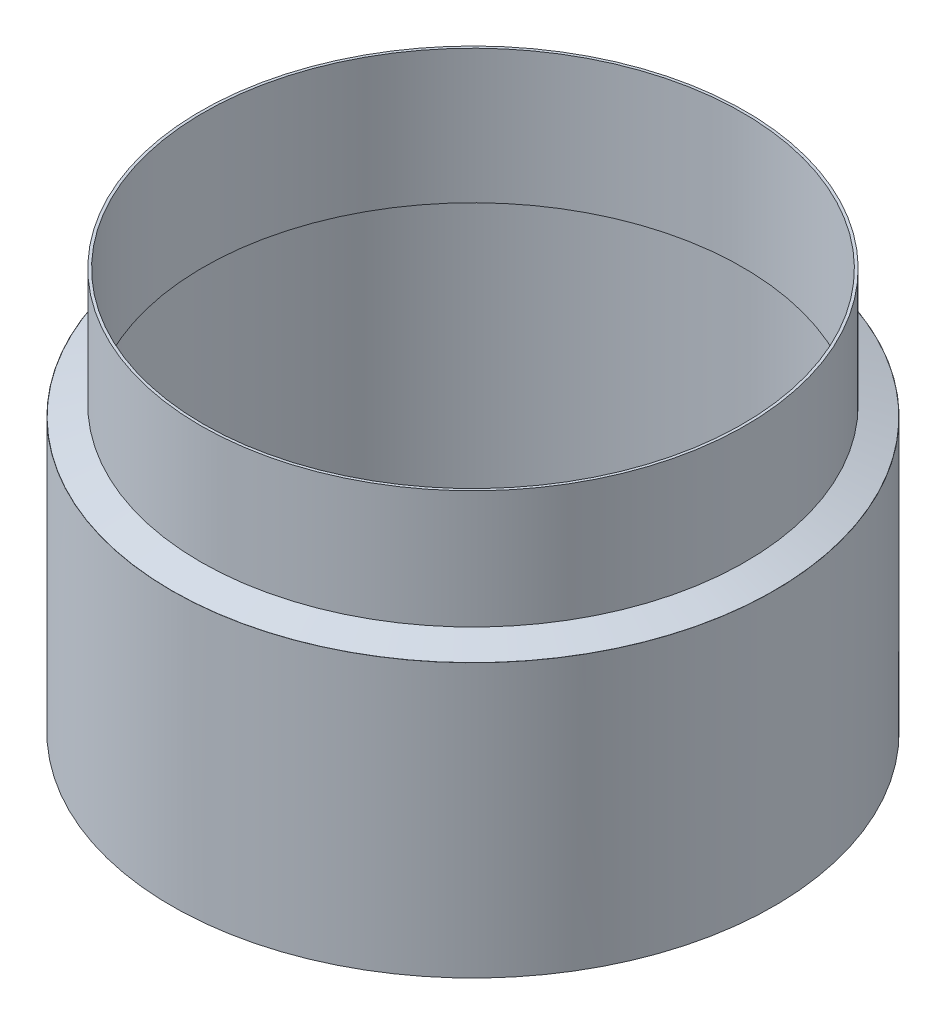
ISO-10303-21;
HEADER;
FILE_DESCRIPTION(('STEP AP214'),'2;1');
FILE_NAME('part.step','',(''),(''),'','','');
FILE_SCHEMA(('AUTOMOTIVE_DESIGN { 1 0 10303 214 1 1 1 1 }'));
ENDSEC;
DATA;
#1=APPLICATION_CONTEXT('core data for automotive mechanical design processes');
#2=APPLICATION_PROTOCOL_DEFINITION('international standard','automotive_design',2000,#1);
#3=PRODUCT_CONTEXT('',#1,'mechanical');
#4=PRODUCT('Part','Part','',(#3));
#5=PRODUCT_RELATED_PRODUCT_CATEGORY('part','',(#4));
#6=PRODUCT_DEFINITION_FORMATION('','',#4);
#7=PRODUCT_DEFINITION_CONTEXT('part definition',#1,'design');
#8=PRODUCT_DEFINITION('design','',#6,#7);
#9=PRODUCT_DEFINITION_SHAPE('','',#8);
#10=(LENGTH_UNIT() NAMED_UNIT(*) SI_UNIT(.MILLI.,.METRE.));
#11=(NAMED_UNIT(*) PLANE_ANGLE_UNIT() SI_UNIT($,.RADIAN.));
#12=(NAMED_UNIT(*) SI_UNIT($,.STERADIAN.) SOLID_ANGLE_UNIT());
#13=UNCERTAINTY_MEASURE_WITH_UNIT(LENGTH_MEASURE(1.E-05),#10,'distance_accuracy_value','');
#14=(GEOMETRIC_REPRESENTATION_CONTEXT(3) GLOBAL_UNCERTAINTY_ASSIGNED_CONTEXT((#13)) GLOBAL_UNIT_ASSIGNED_CONTEXT((#10,
#11,#12)) REPRESENTATION_CONTEXT('',''));
#15=CARTESIAN_POINT('',(0.,0.,0.));
#16=DIRECTION('',(0.,0.,1.));
#17=DIRECTION('',(1.,0.,0.));
#18=AXIS2_PLACEMENT_3D('',#15,#16,#17);
#19=CARTESIAN_POINT('',(0.,0.,0.));
#20=DIRECTION('',(0.,1.,0.));
#21=DIRECTION('',(0.,0.,1.));
#22=AXIS2_PLACEMENT_3D('',#19,#20,#21);
#23=PLANE('',#22);
#24=CARTESIAN_POINT('',(0.,0.,0.));
#25=DIRECTION('',(0.,1.,0.));
#26=DIRECTION('',(0.,0.,1.));
#27=AXIS2_PLACEMENT_3D('',#24,#25,#26);
#28=CIRCLE('',#27,40.3);
#29=CARTESIAN_POINT('',(0.,0.,40.3));
#30=VERTEX_POINT('',#29);
#31=EDGE_CURVE('E76',#30,#30,#28,.T.);
#32=ORIENTED_EDGE('',*,*,#31,.T.);
#33=EDGE_LOOP('',(#32));
#34=FACE_BOUND('',#33,.T.);
#35=CARTESIAN_POINT('',(0.,0.,0.));
#36=DIRECTION('',(0.,-1.,0.));
#37=DIRECTION('',(0.,0.,-1.));
#38=AXIS2_PLACEMENT_3D('',#35,#36,#37);
#39=CIRCLE('',#38,44.225);
#40=CARTESIAN_POINT('',(0.,0.,-44.225));
#41=VERTEX_POINT('',#40);
#42=EDGE_CURVE('E91',#41,#41,#39,.T.);
#43=ORIENTED_EDGE('',*,*,#42,.T.);
#44=EDGE_LOOP('',(#43));
#45=FACE_BOUND('',#44,.T.);
#46=ADVANCED_FACE('F49',(#34,#45),#23,.F.);
#47=CARTESIAN_POINT('',(0.,20.,0.));
#48=DIRECTION('',(0.,1.,0.));
#49=DIRECTION('',(0.,0.,1.));
#50=AXIS2_PLACEMENT_3D('',#47,#48,#49);
#51=PLANE('',#50);
#52=CARTESIAN_POINT('',(0.,20.,0.));
#53=DIRECTION('',(0.,1.,0.));
#54=DIRECTION('',(0.,0.,1.));
#55=AXIS2_PLACEMENT_3D('',#52,#53,#54);
#56=CIRCLE('',#55,40.7);
#57=CARTESIAN_POINT('',(0.,20.,40.7));
#58=VERTEX_POINT('',#57);
#59=EDGE_CURVE('E65',#58,#58,#56,.T.);
#60=ORIENTED_EDGE('',*,*,#59,.T.);
#61=EDGE_LOOP('',(#60));
#62=FACE_BOUND('',#61,.T.);
#63=CARTESIAN_POINT('',(0.,20.,0.));
#64=DIRECTION('',(0.,1.,0.));
#65=DIRECTION('',(0.,0.,1.));
#66=AXIS2_PLACEMENT_3D('',#63,#64,#65);
#67=CIRCLE('',#66,40.3);
#68=CARTESIAN_POINT('',(0.,20.,40.3));
#69=VERTEX_POINT('',#68);
#70=EDGE_CURVE('E73',#69,#69,#67,.T.);
#71=ORIENTED_EDGE('',*,*,#70,.F.);
#72=EDGE_LOOP('',(#71));
#73=FACE_BOUND('',#72,.T.);
#74=ADVANCED_FACE('F116',(#62,#73),#51,.T.);
#75=CARTESIAN_POINT('',(0.,20.,0.));
#76=DIRECTION('',(0.,-1.,0.));
#77=DIRECTION('',(0.,0.,-1.));
#78=AXIS2_PLACEMENT_3D('',#75,#76,#77);
#79=CYLINDRICAL_SURFACE('',#78,40.7);
#80=CARTESIAN_POINT('',(0.,2.36507200734468,0.));
#81=DIRECTION('',(0.,1.,0.));
#82=DIRECTION('',(0.,0.,1.));
#83=AXIS2_PLACEMENT_3D('',#80,#81,#82);
#84=CIRCLE('',#83,40.7);
#85=CARTESIAN_POINT('',(0.,2.36507200734468,40.7));
#86=VERTEX_POINT('',#85);
#87=EDGE_CURVE('E58',#86,#86,#84,.T.);
#88=ORIENTED_EDGE('',*,*,#87,.T.);
#89=EDGE_LOOP('',(#88));
#90=FACE_BOUND('',#89,.T.);
#91=ORIENTED_EDGE('',*,*,#59,.F.);
#92=EDGE_LOOP('',(#91));
#93=FACE_BOUND('',#92,.T.);
#94=ADVANCED_FACE('F122',(#90,#93),#79,.T.);
#95=CARTESIAN_POINT('',(0.,20.,0.));
#96=DIRECTION('',(0.,-1.,0.));
#97=DIRECTION('',(0.,0.,-1.));
#98=AXIS2_PLACEMENT_3D('',#95,#96,#97);
#99=CYLINDRICAL_SURFACE('',#98,40.3);
#100=ORIENTED_EDGE('',*,*,#70,.T.);
#101=EDGE_LOOP('',(#100));
#102=FACE_BOUND('',#101,.T.);
#103=ORIENTED_EDGE('',*,*,#31,.F.);
#104=EDGE_LOOP('',(#103));
#105=FACE_BOUND('',#104,.T.);
#106=ADVANCED_FACE('F128',(#102,#105),#99,.F.);
#107=CARTESIAN_POINT('',(0.,0.8,0.));
#108=DIRECTION('',(0.,1.,0.));
#109=DIRECTION('',(0.,0.,1.));
#110=AXIS2_PLACEMENT_3D('',#107,#108,#109);
#111=PLANE('',#110);
#112=CARTESIAN_POINT('',(0.,0.8,0.));
#113=DIRECTION('',(0.,1.,0.));
#114=DIRECTION('',(0.,0.,1.));
#115=AXIS2_PLACEMENT_3D('',#112,#113,#114);
#116=CIRCLE('',#115,45.);
#117=CARTESIAN_POINT('',(0.,0.8,45.));
#118=VERTEX_POINT('',#117);
#119=EDGE_CURVE('E10',#118,#118,#116,.F.);
#120=ORIENTED_EDGE('',*,*,#119,.T.);
#121=EDGE_LOOP('',(#120));
#122=FACE_BOUND('',#121,.T.);
#123=CARTESIAN_POINT('',(0.,0.8,0.));
#124=DIRECTION('',(0.,1.,0.));
#125=DIRECTION('',(0.,0.,1.));
#126=AXIS2_PLACEMENT_3D('',#123,#124,#125);
#127=CIRCLE('',#126,45.0249999999999);
#128=CARTESIAN_POINT('',(0.,0.8,45.0249999999999));
#129=VERTEX_POINT('',#128);
#130=EDGE_CURVE('E80',#129,#129,#127,.T.);
#131=ORIENTED_EDGE('',*,*,#130,.T.);
#132=EDGE_LOOP('',(#131));
#133=FACE_BOUND('',#132,.T.);
#134=ADVANCED_FACE('F111',(#122,#133),#111,.T.);
#135=CARTESIAN_POINT('',(0.,0.8,0.));
#136=DIRECTION('',(0.,-1.,0.));
#137=DIRECTION('',(0.,0.,-1.));
#138=AXIS2_PLACEMENT_3D('',#135,#136,#137);
#139=CYLINDRICAL_SURFACE('',#138,45.0249999999999);
#140=ORIENTED_EDGE('',*,*,#130,.F.);
#141=EDGE_LOOP('',(#140));
#142=FACE_BOUND('',#141,.T.);
#143=CARTESIAN_POINT('',(0.,-40.,0.));
#144=DIRECTION('',(0.,-1.,0.));
#145=DIRECTION('',(0.,0.,-1.));
#146=AXIS2_PLACEMENT_3D('',#143,#144,#145);
#147=CIRCLE('',#146,45.0249999999999);
#148=CARTESIAN_POINT('',(0.,-40.,-45.0249999999999));
#149=VERTEX_POINT('',#148);
#150=EDGE_CURVE('E86',#149,#149,#147,.T.);
#151=ORIENTED_EDGE('',*,*,#150,.F.);
#152=EDGE_LOOP('',(#151));
#153=FACE_BOUND('',#152,.T.);
#154=ADVANCED_FACE('F103',(#142,#153),#139,.T.);
#155=CARTESIAN_POINT('',(0.,-40.,0.));
#156=DIRECTION('',(0.,-1.,0.));
#157=DIRECTION('',(0.,0.,-1.));
#158=AXIS2_PLACEMENT_3D('',#155,#156,#157);
#159=PLANE('',#158);
#160=ORIENTED_EDGE('',*,*,#150,.T.);
#161=EDGE_LOOP('',(#160));
#162=FACE_BOUND('',#161,.T.);
#163=CARTESIAN_POINT('',(0.,-40.,0.));
#164=DIRECTION('',(0.,-1.,0.));
#165=DIRECTION('',(0.,0.,-1.));
#166=AXIS2_PLACEMENT_3D('',#163,#164,#165);
#167=CIRCLE('',#166,44.225);
#168=CARTESIAN_POINT('',(0.,-40.,-44.225));
#169=VERTEX_POINT('',#168);
#170=EDGE_CURVE('E90',#169,#169,#167,.T.);
#171=ORIENTED_EDGE('',*,*,#170,.F.);
#172=EDGE_LOOP('',(#171));
#173=FACE_BOUND('',#172,.T.);
#174=ADVANCED_FACE('F101',(#162,#173),#159,.T.);
#175=CARTESIAN_POINT('',(0.,-40.,0.));
#176=DIRECTION('',(0.,1.,0.));
#177=DIRECTION('',(0.,0.,1.));
#178=AXIS2_PLACEMENT_3D('',#175,#176,#177);
#179=CYLINDRICAL_SURFACE('',#178,44.225);
#180=ORIENTED_EDGE('',*,*,#170,.T.);
#181=EDGE_LOOP('',(#180));
#182=FACE_BOUND('',#181,.T.);
#183=ORIENTED_EDGE('',*,*,#42,.F.);
#184=EDGE_LOOP('',(#183));
#185=FACE_BOUND('',#184,.T.);
#186=ADVANCED_FACE('F98',(#182,#185),#179,.F.);
#187=CARTESIAN_POINT('',(0.,2.36507200734468,0.));
#188=DIRECTION('',(0.,-1.,0.));
#189=DIRECTION('',(0.,0.,-1.));
#190=AXIS2_PLACEMENT_3D('',#187,#188,#189);
#191=CONICAL_SURFACE('',#190,40.7,1.22173047639603);
#192=ORIENTED_EDGE('',*,*,#119,.F.);
#193=EDGE_LOOP('',(#192));
#194=FACE_BOUND('',#193,.T.);
#195=ORIENTED_EDGE('',*,*,#87,.F.);
#196=EDGE_LOOP('',(#195));
#197=FACE_BOUND('',#196,.T.);
#198=ADVANCED_FACE('F52',(#194,#197),#191,.T.);
#199=CLOSED_SHELL('',(#46,#74,#94,#106,#134,#154,#174,#186,#198));
#200=MANIFOLD_SOLID_BREP('B2',#199);
#201=ADVANCED_BREP_SHAPE_REPRESENTATION('',(#18,#200),#14);
#202=SHAPE_DEFINITION_REPRESENTATION(#9,#201);
ENDSEC;
END-ISO-10303-21;
